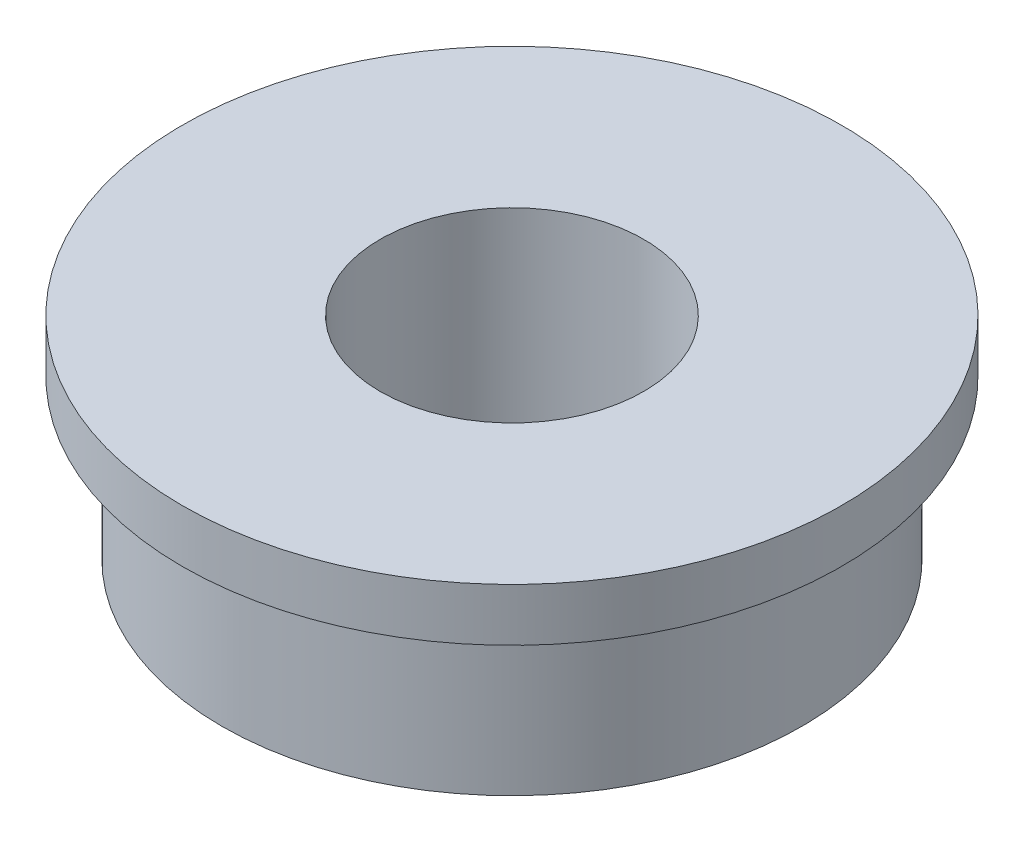
ISO-10303-21;
HEADER;
FILE_DESCRIPTION(('STEP AP214'),'2;1');
FILE_NAME('part.step','',(''),(''),'','','');
FILE_SCHEMA(('AUTOMOTIVE_DESIGN { 1 0 10303 214 1 1 1 1 }'));
ENDSEC;
DATA;
#1=APPLICATION_CONTEXT('core data for automotive mechanical design processes');
#2=APPLICATION_PROTOCOL_DEFINITION('international standard','automotive_design',2000,#1);
#3=PRODUCT_CONTEXT('',#1,'mechanical');
#4=PRODUCT('Part','Part','',(#3));
#5=PRODUCT_RELATED_PRODUCT_CATEGORY('part','',(#4));
#6=PRODUCT_DEFINITION_FORMATION('','',#4);
#7=PRODUCT_DEFINITION_CONTEXT('part definition',#1,'design');
#8=PRODUCT_DEFINITION('design','',#6,#7);
#9=PRODUCT_DEFINITION_SHAPE('','',#8);
#10=(LENGTH_UNIT() NAMED_UNIT(*) SI_UNIT(.MILLI.,.METRE.));
#11=(NAMED_UNIT(*) PLANE_ANGLE_UNIT() SI_UNIT($,.RADIAN.));
#12=(NAMED_UNIT(*) SI_UNIT($,.STERADIAN.) SOLID_ANGLE_UNIT());
#13=UNCERTAINTY_MEASURE_WITH_UNIT(LENGTH_MEASURE(1.E-05),#10,'distance_accuracy_value','');
#14=(GEOMETRIC_REPRESENTATION_CONTEXT(3) GLOBAL_UNCERTAINTY_ASSIGNED_CONTEXT((#13)) GLOBAL_UNIT_ASSIGNED_CONTEXT((#10,
#11,#12)) REPRESENTATION_CONTEXT('',''));
#15=CARTESIAN_POINT('',(0.,0.,0.));
#16=DIRECTION('',(0.,0.,1.));
#17=DIRECTION('',(1.,0.,0.));
#18=AXIS2_PLACEMENT_3D('',#15,#16,#17);
#19=CARTESIAN_POINT('',(0.,9.32958992096213,0.));
#20=DIRECTION('',(0.,1.,0.));
#21=DIRECTION('',(0.,0.,1.));
#22=AXIS2_PLACEMENT_3D('',#19,#20,#21);
#23=CYLINDRICAL_SURFACE('',#22,5.5);
#24=CARTESIAN_POINT('',(0.,3.,0.));
#25=DIRECTION('',(0.,1.,0.));
#26=DIRECTION('',(0.,0.,1.));
#27=AXIS2_PLACEMENT_3D('',#24,#25,#26);
#28=CIRCLE('',#27,5.5);
#29=CARTESIAN_POINT('',(0.,3.,5.5));
#30=VERTEX_POINT('',#29);
#31=EDGE_CURVE('E64',#30,#30,#28,.T.);
#32=ORIENTED_EDGE('',*,*,#31,.F.);
#33=EDGE_LOOP('',(#32));
#34=FACE_BOUND('',#33,.T.);
#35=CARTESIAN_POINT('',(0.,0.,0.));
#36=DIRECTION('',(0.,1.,0.));
#37=DIRECTION('',(0.,0.,1.));
#38=AXIS2_PLACEMENT_3D('',#35,#36,#37);
#39=CIRCLE('',#38,5.5);
#40=CARTESIAN_POINT('',(0.,0.,5.5));
#41=VERTEX_POINT('',#40);
#42=EDGE_CURVE('E10',#41,#41,#39,.T.);
#43=ORIENTED_EDGE('',*,*,#42,.T.);
#44=EDGE_LOOP('',(#43));
#45=FACE_BOUND('',#44,.T.);
#46=ADVANCED_FACE('F37',(#34,#45),#23,.T.);
#47=CARTESIAN_POINT('',(0.,0.,-2.5));
#48=DIRECTION('',(0.,1.,0.));
#49=DIRECTION('',(0.,0.,1.));
#50=AXIS2_PLACEMENT_3D('',#47,#48,#49);
#51=PLANE('',#50);
#52=ORIENTED_EDGE('',*,*,#42,.F.);
#53=EDGE_LOOP('',(#52));
#54=FACE_BOUND('',#53,.T.);
#55=CARTESIAN_POINT('',(0.,0.,0.));
#56=DIRECTION('',(0.,1.,0.));
#57=DIRECTION('',(0.,0.,1.));
#58=AXIS2_PLACEMENT_3D('',#55,#56,#57);
#59=CIRCLE('',#58,2.5);
#60=CARTESIAN_POINT('',(0.,0.,2.5));
#61=VERTEX_POINT('',#60);
#62=EDGE_CURVE('E44',#61,#61,#59,.T.);
#63=ORIENTED_EDGE('',*,*,#62,.T.);
#64=EDGE_LOOP('',(#63));
#65=FACE_BOUND('',#64,.T.);
#66=ADVANCED_FACE('F72',(#54,#65),#51,.F.);
#67=CARTESIAN_POINT('',(0.,9.32958992096213,0.));
#68=DIRECTION('',(0.,1.,0.));
#69=DIRECTION('',(0.,0.,1.));
#70=AXIS2_PLACEMENT_3D('',#67,#68,#69);
#71=CYLINDRICAL_SURFACE('',#70,2.5);
#72=ORIENTED_EDGE('',*,*,#62,.F.);
#73=EDGE_LOOP('',(#72));
#74=FACE_BOUND('',#73,.T.);
#75=CARTESIAN_POINT('',(0.,4.,0.));
#76=DIRECTION('',(0.,1.,0.));
#77=DIRECTION('',(0.,0.,1.));
#78=AXIS2_PLACEMENT_3D('',#75,#76,#77);
#79=CIRCLE('',#78,2.5);
#80=CARTESIAN_POINT('',(0.,4.,2.5));
#81=VERTEX_POINT('',#80);
#82=EDGE_CURVE('E49',#81,#81,#79,.T.);
#83=ORIENTED_EDGE('',*,*,#82,.T.);
#84=EDGE_LOOP('',(#83));
#85=FACE_BOUND('',#84,.T.);
#86=ADVANCED_FACE('F76',(#74,#85),#71,.F.);
#87=CARTESIAN_POINT('',(0.,4.,-6.25));
#88=DIRECTION('',(0.,-1.,0.));
#89=DIRECTION('',(0.,0.,-1.));
#90=AXIS2_PLACEMENT_3D('',#87,#88,#89);
#91=PLANE('',#90);
#92=ORIENTED_EDGE('',*,*,#82,.F.);
#93=EDGE_LOOP('',(#92));
#94=FACE_BOUND('',#93,.T.);
#95=CARTESIAN_POINT('',(0.,4.,0.));
#96=DIRECTION('',(0.,1.,0.));
#97=DIRECTION('',(0.,0.,1.));
#98=AXIS2_PLACEMENT_3D('',#95,#96,#97);
#99=CIRCLE('',#98,6.25);
#100=CARTESIAN_POINT('',(0.,4.,6.25));
#101=VERTEX_POINT('',#100);
#102=EDGE_CURVE('E54',#101,#101,#99,.T.);
#103=ORIENTED_EDGE('',*,*,#102,.T.);
#104=EDGE_LOOP('',(#103));
#105=FACE_BOUND('',#104,.T.);
#106=ADVANCED_FACE('F81',(#94,#105),#91,.F.);
#107=CARTESIAN_POINT('',(0.,9.32958992096213,0.));
#108=DIRECTION('',(0.,1.,0.));
#109=DIRECTION('',(0.,0.,1.));
#110=AXIS2_PLACEMENT_3D('',#107,#108,#109);
#111=CYLINDRICAL_SURFACE('',#110,6.25);
#112=ORIENTED_EDGE('',*,*,#102,.F.);
#113=EDGE_LOOP('',(#112));
#114=FACE_BOUND('',#113,.T.);
#115=CARTESIAN_POINT('',(0.,3.,0.));
#116=DIRECTION('',(0.,1.,0.));
#117=DIRECTION('',(0.,0.,1.));
#118=AXIS2_PLACEMENT_3D('',#115,#116,#117);
#119=CIRCLE('',#118,6.25);
#120=CARTESIAN_POINT('',(0.,3.,6.25));
#121=VERTEX_POINT('',#120);
#122=EDGE_CURVE('E60',#121,#121,#119,.T.);
#123=ORIENTED_EDGE('',*,*,#122,.T.);
#124=EDGE_LOOP('',(#123));
#125=FACE_BOUND('',#124,.T.);
#126=ADVANCED_FACE('F87',(#114,#125),#111,.T.);
#127=CARTESIAN_POINT('',(0.,3.,-5.5));
#128=DIRECTION('',(0.,1.,0.));
#129=DIRECTION('',(0.,0.,1.));
#130=AXIS2_PLACEMENT_3D('',#127,#128,#129);
#131=PLANE('',#130);
#132=ORIENTED_EDGE('',*,*,#122,.F.);
#133=EDGE_LOOP('',(#132));
#134=FACE_BOUND('',#133,.T.);
#135=ORIENTED_EDGE('',*,*,#31,.T.);
#136=EDGE_LOOP('',(#135));
#137=FACE_BOUND('',#136,.T.);
#138=ADVANCED_FACE('F69',(#134,#137),#131,.F.);
#139=CLOSED_SHELL('',(#46,#66,#86,#106,#126,#138));
#140=MANIFOLD_SOLID_BREP('B2',#139);
#141=ADVANCED_BREP_SHAPE_REPRESENTATION('',(#18,#140),#14);
#142=SHAPE_DEFINITION_REPRESENTATION(#9,#141);
ENDSEC;
END-ISO-10303-21;
